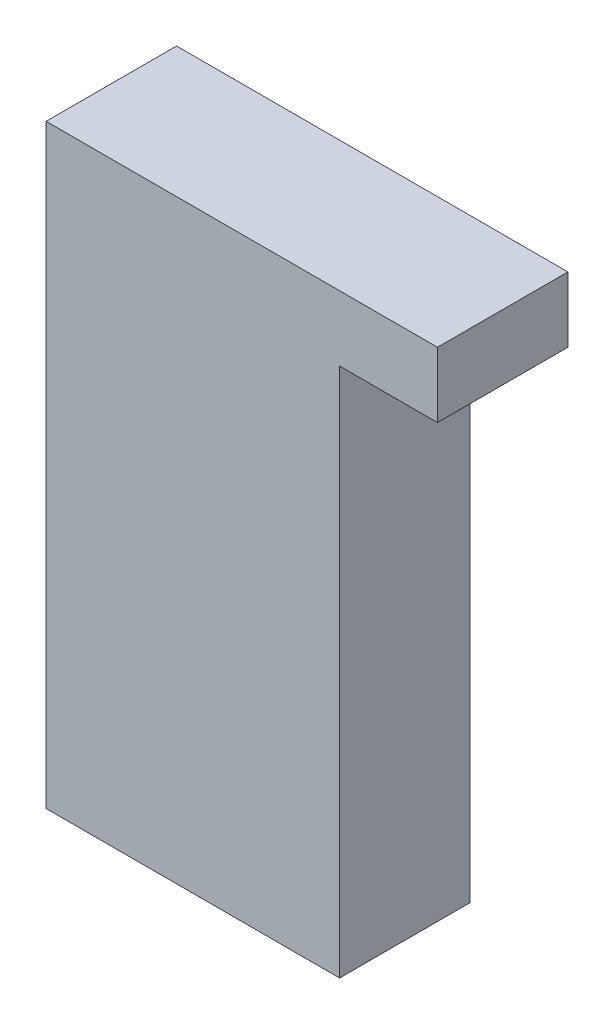
ISO-10303-21;
HEADER;
FILE_DESCRIPTION(('STEP AP214'),'2;1');
FILE_NAME('part.step','',(''),(''),'','','');
FILE_SCHEMA(('AUTOMOTIVE_DESIGN { 1 0 10303 214 1 1 1 1 }'));
ENDSEC;
DATA;
#1=APPLICATION_CONTEXT('core data for automotive mechanical design processes');
#2=APPLICATION_PROTOCOL_DEFINITION('international standard','automotive_design',2000,#1);
#3=PRODUCT_CONTEXT('',#1,'mechanical');
#4=PRODUCT('Part','Part','',(#3));
#5=PRODUCT_RELATED_PRODUCT_CATEGORY('part','',(#4));
#6=PRODUCT_DEFINITION_FORMATION('','',#4);
#7=PRODUCT_DEFINITION_CONTEXT('part definition',#1,'design');
#8=PRODUCT_DEFINITION('design','',#6,#7);
#9=PRODUCT_DEFINITION_SHAPE('','',#8);
#10=(LENGTH_UNIT() NAMED_UNIT(*) SI_UNIT(.MILLI.,.METRE.));
#11=(NAMED_UNIT(*) PLANE_ANGLE_UNIT() SI_UNIT($,.RADIAN.));
#12=(NAMED_UNIT(*) SI_UNIT($,.STERADIAN.) SOLID_ANGLE_UNIT());
#13=UNCERTAINTY_MEASURE_WITH_UNIT(LENGTH_MEASURE(1.E-05),#10,'distance_accuracy_value','');
#14=(GEOMETRIC_REPRESENTATION_CONTEXT(3) GLOBAL_UNCERTAINTY_ASSIGNED_CONTEXT((#13)) GLOBAL_UNIT_ASSIGNED_CONTEXT((#10,
#11,#12)) REPRESENTATION_CONTEXT('',''));
#15=CARTESIAN_POINT('',(0.,0.,0.));
#16=DIRECTION('',(0.,0.,1.));
#17=DIRECTION('',(1.,0.,0.));
#18=AXIS2_PLACEMENT_3D('',#15,#16,#17);
#19=CARTESIAN_POINT('',(18.,73.,-7.99999999999999));
#20=DIRECTION('',(-1.,0.,0.));
#21=DIRECTION('',(0.,0.,1.));
#22=AXIS2_PLACEMENT_3D('',#19,#20,#21);
#23=PLANE('',#22);
#24=DIRECTION('',(0.,0.,-1.));
#25=VECTOR('',#24,1.);
#26=CARTESIAN_POINT('',(18.,64.9999999999999,8.00000000000001));
#27=LINE('',#26,#25);
#28=CARTESIAN_POINT('',(18.,64.9999999999999,8.00000000000001));
#29=VERTEX_POINT('',#28);
#30=CARTESIAN_POINT('',(18.,64.9999999999999,-7.99999999999999));
#31=VERTEX_POINT('',#30);
#32=EDGE_CURVE('E51',#29,#31,#27,.T.);
#33=ORIENTED_EDGE('',*,*,#32,.F.);
#34=DIRECTION('',(0.,-1.,0.));
#35=VECTOR('',#34,1.);
#36=CARTESIAN_POINT('',(18.,73.,8.00000000000001));
#37=LINE('',#36,#35);
#38=CARTESIAN_POINT('',(18.,0.,8.00000000000001));
#39=VERTEX_POINT('',#38);
#40=EDGE_CURVE('E75',#29,#39,#37,.T.);
#41=ORIENTED_EDGE('',*,*,#40,.T.);
#42=DIRECTION('',(0.,0.,-1.));
#43=VECTOR('',#42,1.);
#44=CARTESIAN_POINT('',(18.,0.,-7.99999999999999));
#45=LINE('',#44,#43);
#46=CARTESIAN_POINT('',(18.,0.,-7.99999999999999));
#47=VERTEX_POINT('',#46);
#48=EDGE_CURVE('E78',#39,#47,#45,.T.);
#49=ORIENTED_EDGE('',*,*,#48,.T.);
#50=DIRECTION('',(0.,-1.,0.));
#51=VECTOR('',#50,1.);
#52=CARTESIAN_POINT('',(18.,73.,-7.99999999999999));
#53=LINE('',#52,#51);
#54=EDGE_CURVE('E11',#31,#47,#53,.T.);
#55=ORIENTED_EDGE('',*,*,#54,.F.);
#56=EDGE_LOOP('',(#33,#41,#49,#55));
#57=FACE_BOUND('',#56,.T.);
#58=ADVANCED_FACE('F37',(#57),#23,.F.);
#59=CARTESIAN_POINT('',(-18.0000000000001,73.,-7.99999999999999));
#60=DIRECTION('',(0.,0.,1.));
#61=DIRECTION('',(1.,0.,0.));
#62=AXIS2_PLACEMENT_3D('',#59,#60,#61);
#63=PLANE('',#62);
#64=DIRECTION('',(-1.,0.,0.));
#65=VECTOR('',#64,1.);
#66=CARTESIAN_POINT('',(-18.0000000000001,0.,-7.99999999999999));
#67=LINE('',#66,#65);
#68=CARTESIAN_POINT('',(-18.0000000000001,0.,-7.99999999999999));
#69=VERTEX_POINT('',#68);
#70=EDGE_CURVE('E97',#47,#69,#67,.T.);
#71=ORIENTED_EDGE('',*,*,#70,.T.);
#72=DIRECTION('',(0.,-1.,0.));
#73=VECTOR('',#72,1.);
#74=CARTESIAN_POINT('',(-18.0000000000001,73.,-7.99999999999999));
#75=LINE('',#74,#73);
#76=CARTESIAN_POINT('',(-18.0000000000001,73.,-7.99999999999999));
#77=VERTEX_POINT('',#76);
#78=EDGE_CURVE('E44',#77,#69,#75,.T.);
#79=ORIENTED_EDGE('',*,*,#78,.F.);
#80=DIRECTION('',(-1.,0.,0.));
#81=VECTOR('',#80,1.);
#82=CARTESIAN_POINT('',(-18.0000000000001,73.,-7.99999999999999));
#83=LINE('',#82,#81);
#84=CARTESIAN_POINT('',(30.,73.,-7.99999999999999));
#85=VERTEX_POINT('',#84);
#86=EDGE_CURVE('E92',#85,#77,#83,.T.);
#87=ORIENTED_EDGE('',*,*,#86,.F.);
#88=DIRECTION('',(0.,1.,0.));
#89=VECTOR('',#88,1.);
#90=CARTESIAN_POINT('',(30.,73.,-7.99999999999999));
#91=LINE('',#90,#89);
#92=CARTESIAN_POINT('',(30.,64.9999999999999,-7.99999999999999));
#93=VERTEX_POINT('',#92);
#94=EDGE_CURVE('E143',#93,#85,#91,.T.);
#95=ORIENTED_EDGE('',*,*,#94,.F.);
#96=DIRECTION('',(-1.,0.,0.));
#97=VECTOR('',#96,1.);
#98=CARTESIAN_POINT('',(30.,64.9999999999999,-7.99999999999999));
#99=LINE('',#98,#97);
#100=EDGE_CURVE('E101',#93,#31,#99,.T.);
#101=ORIENTED_EDGE('',*,*,#100,.T.);
#102=ORIENTED_EDGE('',*,*,#54,.T.);
#103=EDGE_LOOP('',(#71,#79,#87,#95,#101,#102));
#104=FACE_BOUND('',#103,.T.);
#105=ADVANCED_FACE('F113',(#104),#63,.F.);
#106=CARTESIAN_POINT('',(-18.0000000000001,73.,-7.99999999999999));
#107=DIRECTION('',(1.,0.,0.));
#108=DIRECTION('',(0.,0.,-1.));
#109=AXIS2_PLACEMENT_3D('',#106,#107,#108);
#110=PLANE('',#109);
#111=DIRECTION('',(0.,0.,1.));
#112=VECTOR('',#111,1.);
#113=CARTESIAN_POINT('',(-18.0000000000001,0.,-7.99999999999999));
#114=LINE('',#113,#112);
#115=CARTESIAN_POINT('',(-18.,0.,8.00000000000001));
#116=VERTEX_POINT('',#115);
#117=EDGE_CURVE('E93',#69,#116,#114,.T.);
#118=ORIENTED_EDGE('',*,*,#117,.T.);
#119=DIRECTION('',(0.,-1.,0.));
#120=VECTOR('',#119,1.);
#121=CARTESIAN_POINT('',(-18.,73.,8.00000000000001));
#122=LINE('',#121,#120);
#123=CARTESIAN_POINT('',(-18.,73.,8.00000000000001));
#124=VERTEX_POINT('',#123);
#125=EDGE_CURVE('E82',#124,#116,#122,.T.);
#126=ORIENTED_EDGE('',*,*,#125,.F.);
#127=DIRECTION('',(0.,0.,1.));
#128=VECTOR('',#127,1.);
#129=CARTESIAN_POINT('',(-18.0000000000001,73.,-7.99999999999999));
#130=LINE('',#129,#128);
#131=EDGE_CURVE('E60',#77,#124,#130,.T.);
#132=ORIENTED_EDGE('',*,*,#131,.F.);
#133=ORIENTED_EDGE('',*,*,#78,.T.);
#134=EDGE_LOOP('',(#118,#126,#132,#133));
#135=FACE_BOUND('',#134,.T.);
#136=ADVANCED_FACE('F110',(#135),#110,.F.);
#137=CARTESIAN_POINT('',(-18.,73.,8.00000000000001));
#138=DIRECTION('',(0.,0.,-1.));
#139=DIRECTION('',(-1.,0.,0.));
#140=AXIS2_PLACEMENT_3D('',#137,#138,#139);
#141=PLANE('',#140);
#142=DIRECTION('',(1.,0.,0.));
#143=VECTOR('',#142,1.);
#144=CARTESIAN_POINT('',(-18.,0.,8.00000000000001));
#145=LINE('',#144,#143);
#146=EDGE_CURVE('E87',#116,#39,#145,.T.);
#147=ORIENTED_EDGE('',*,*,#146,.T.);
#148=ORIENTED_EDGE('',*,*,#40,.F.);
#149=DIRECTION('',(-1.,0.,0.));
#150=VECTOR('',#149,1.);
#151=CARTESIAN_POINT('',(30.,64.9999999999999,8.00000000000001));
#152=LINE('',#151,#150);
#153=CARTESIAN_POINT('',(30.,64.9999999999999,8.00000000000001));
#154=VERTEX_POINT('',#153);
#155=EDGE_CURVE('E98',#154,#29,#152,.T.);
#156=ORIENTED_EDGE('',*,*,#155,.F.);
#157=DIRECTION('',(0.,-1.,0.));
#158=VECTOR('',#157,1.);
#159=CARTESIAN_POINT('',(30.,73.,8.00000000000001));
#160=LINE('',#159,#158);
#161=CARTESIAN_POINT('',(30.,73.,8.00000000000001));
#162=VERTEX_POINT('',#161);
#163=EDGE_CURVE('E125',#162,#154,#160,.T.);
#164=ORIENTED_EDGE('',*,*,#163,.F.);
#165=DIRECTION('',(1.,0.,0.));
#166=VECTOR('',#165,1.);
#167=CARTESIAN_POINT('',(-18.,73.,8.00000000000001));
#168=LINE('',#167,#166);
#169=EDGE_CURVE('E83',#124,#162,#168,.T.);
#170=ORIENTED_EDGE('',*,*,#169,.F.);
#171=ORIENTED_EDGE('',*,*,#125,.T.);
#172=EDGE_LOOP('',(#147,#148,#156,#164,#170,#171));
#173=FACE_BOUND('',#172,.T.);
#174=ADVANCED_FACE('F88',(#173),#141,.F.);
#175=CARTESIAN_POINT('',(0.,73.,0.));
#176=DIRECTION('',(0.,1.,0.));
#177=DIRECTION('',(0.,0.,1.));
#178=AXIS2_PLACEMENT_3D('',#175,#176,#177);
#179=PLANE('',#178);
#180=ORIENTED_EDGE('',*,*,#169,.T.);
#181=DIRECTION('',(0.,0.,1.));
#182=VECTOR('',#181,1.);
#183=CARTESIAN_POINT('',(30.,73.,8.00000000000001));
#184=LINE('',#183,#182);
#185=EDGE_CURVE('E132',#85,#162,#184,.T.);
#186=ORIENTED_EDGE('',*,*,#185,.F.);
#187=ORIENTED_EDGE('',*,*,#86,.T.);
#188=ORIENTED_EDGE('',*,*,#131,.T.);
#189=EDGE_LOOP('',(#180,#186,#187,#188));
#190=FACE_BOUND('',#189,.T.);
#191=ADVANCED_FACE('F137',(#190),#179,.T.);
#192=CARTESIAN_POINT('',(0.,0.,0.));
#193=DIRECTION('',(0.,1.,0.));
#194=DIRECTION('',(0.,0.,1.));
#195=AXIS2_PLACEMENT_3D('',#192,#193,#194);
#196=PLANE('',#195);
#197=ORIENTED_EDGE('',*,*,#48,.F.);
#198=ORIENTED_EDGE('',*,*,#146,.F.);
#199=ORIENTED_EDGE('',*,*,#117,.F.);
#200=ORIENTED_EDGE('',*,*,#70,.F.);
#201=EDGE_LOOP('',(#197,#198,#199,#200));
#202=FACE_BOUND('',#201,.T.);
#203=ADVANCED_FACE('F96',(#202),#196,.F.);
#204=CARTESIAN_POINT('',(30.,64.9999999999999,8.00000000000001));
#205=DIRECTION('',(0.,1.,0.));
#206=DIRECTION('',(0.,0.,1.));
#207=AXIS2_PLACEMENT_3D('',#204,#205,#206);
#208=PLANE('',#207);
#209=ORIENTED_EDGE('',*,*,#32,.T.);
#210=ORIENTED_EDGE('',*,*,#100,.F.);
#211=DIRECTION('',(0.,0.,-1.));
#212=VECTOR('',#211,1.);
#213=CARTESIAN_POINT('',(30.,64.9999999999999,8.00000000000001));
#214=LINE('',#213,#212);
#215=EDGE_CURVE('E128',#154,#93,#214,.T.);
#216=ORIENTED_EDGE('',*,*,#215,.F.);
#217=ORIENTED_EDGE('',*,*,#155,.T.);
#218=EDGE_LOOP('',(#209,#210,#216,#217));
#219=FACE_BOUND('',#218,.T.);
#220=ADVANCED_FACE('F122',(#219),#208,.F.);
#221=CARTESIAN_POINT('',(30.,0.,0.));
#222=DIRECTION('',(1.,0.,0.));
#223=DIRECTION('',(0.,0.,-1.));
#224=AXIS2_PLACEMENT_3D('',#221,#222,#223);
#225=PLANE('',#224);
#226=ORIENTED_EDGE('',*,*,#163,.T.);
#227=ORIENTED_EDGE('',*,*,#215,.T.);
#228=ORIENTED_EDGE('',*,*,#94,.T.);
#229=ORIENTED_EDGE('',*,*,#185,.T.);
#230=EDGE_LOOP('',(#226,#227,#228,#229));
#231=FACE_BOUND('',#230,.T.);
#232=ADVANCED_FACE('F141',(#231),#225,.T.);
#233=CLOSED_SHELL('',(#58,#105,#136,#174,#191,#203,#220,#232));
#234=MANIFOLD_SOLID_BREP('B2',#233);
#235=ADVANCED_BREP_SHAPE_REPRESENTATION('',(#18,#234),#14);
#236=SHAPE_DEFINITION_REPRESENTATION(#9,#235);
ENDSEC;
END-ISO-10303-21;
